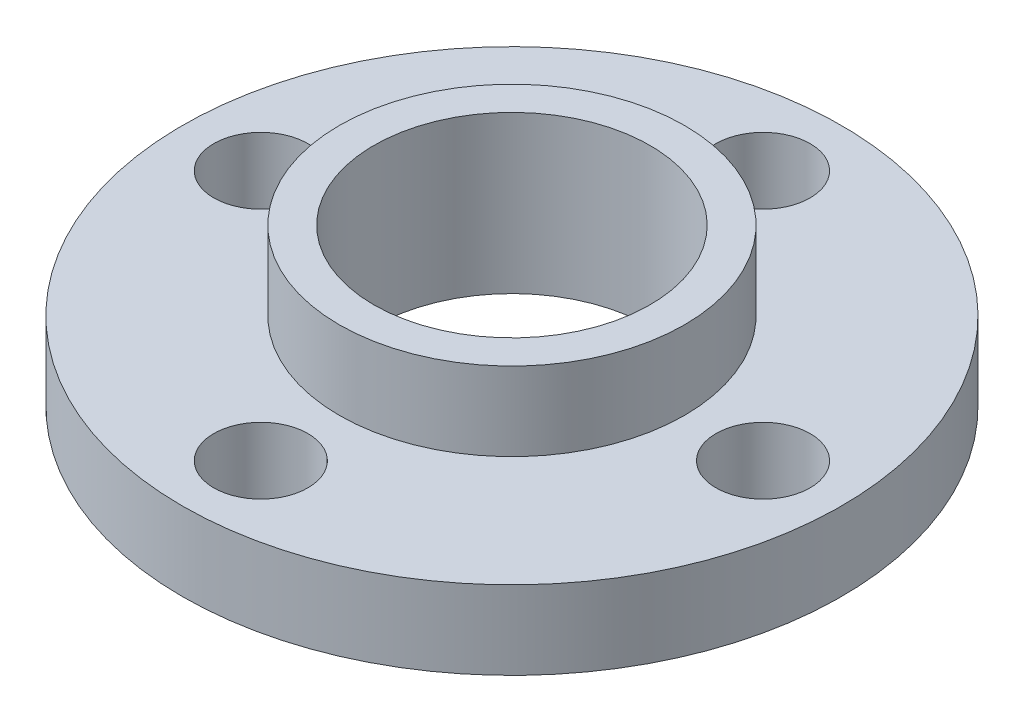
ISO-10303-21;
HEADER;
FILE_DESCRIPTION(('STEP AP214'),'2;1');
FILE_NAME('part.step','',(''),(''),'','','');
FILE_SCHEMA(('AUTOMOTIVE_DESIGN { 1 0 10303 214 1 1 1 1 }'));
ENDSEC;
DATA;
#1=APPLICATION_CONTEXT('core data for automotive mechanical design processes');
#2=APPLICATION_PROTOCOL_DEFINITION('international standard','automotive_design',2000,#1);
#3=PRODUCT_CONTEXT('',#1,'mechanical');
#4=PRODUCT('Part','Part','',(#3));
#5=PRODUCT_RELATED_PRODUCT_CATEGORY('part','',(#4));
#6=PRODUCT_DEFINITION_FORMATION('','',#4);
#7=PRODUCT_DEFINITION_CONTEXT('part definition',#1,'design');
#8=PRODUCT_DEFINITION('design','',#6,#7);
#9=PRODUCT_DEFINITION_SHAPE('','',#8);
#10=(LENGTH_UNIT() NAMED_UNIT(*) SI_UNIT(.MILLI.,.METRE.));
#11=(NAMED_UNIT(*) PLANE_ANGLE_UNIT() SI_UNIT($,.RADIAN.));
#12=(NAMED_UNIT(*) SI_UNIT($,.STERADIAN.) SOLID_ANGLE_UNIT());
#13=UNCERTAINTY_MEASURE_WITH_UNIT(LENGTH_MEASURE(1.E-05),#10,'distance_accuracy_value','');
#14=(GEOMETRIC_REPRESENTATION_CONTEXT(3) GLOBAL_UNCERTAINTY_ASSIGNED_CONTEXT((#13)) GLOBAL_UNIT_ASSIGNED_CONTEXT((#10,
#11,#12)) REPRESENTATION_CONTEXT('',''));
#15=CARTESIAN_POINT('',(0.,0.,0.));
#16=DIRECTION('',(0.,0.,1.));
#17=DIRECTION('',(1.,0.,0.));
#18=AXIS2_PLACEMENT_3D('',#15,#16,#17);
#19=CARTESIAN_POINT('',(0.,2.5,0.));
#20=DIRECTION('',(0.,1.,0.));
#21=DIRECTION('',(0.,0.,1.));
#22=AXIS2_PLACEMENT_3D('',#19,#20,#21);
#23=PLANE('',#22);
#24=CARTESIAN_POINT('',(0.,2.5,8.));
#25=DIRECTION('',(0.,1.,0.));
#26=DIRECTION('',(1.,0.,0.));
#27=AXIS2_PLACEMENT_3D('',#24,#25,#26);
#28=CIRCLE('',#27,1.5);
#29=CARTESIAN_POINT('',(1.50000000000003,2.5,7.99999999999999));
#30=VERTEX_POINT('',#29);
#31=EDGE_CURVE('E75',#30,#30,#28,.T.);
#32=ORIENTED_EDGE('',*,*,#31,.F.);
#33=EDGE_LOOP('',(#32));
#34=FACE_BOUND('',#33,.T.);
#35=CARTESIAN_POINT('',(8.,2.5,0.));
#36=DIRECTION('',(0.,1.,0.));
#37=DIRECTION('',(0.,0.,-1.));
#38=AXIS2_PLACEMENT_3D('',#35,#36,#37);
#39=CIRCLE('',#38,1.5);
#40=CARTESIAN_POINT('',(8.,2.5,-1.5));
#41=VERTEX_POINT('',#40);
#42=EDGE_CURVE('E69',#41,#41,#39,.T.);
#43=ORIENTED_EDGE('',*,*,#42,.F.);
#44=EDGE_LOOP('',(#43));
#45=FACE_BOUND('',#44,.T.);
#46=CARTESIAN_POINT('',(0.,2.5,-8.));
#47=DIRECTION('',(0.,1.,0.));
#48=DIRECTION('',(-1.,0.,0.));
#49=AXIS2_PLACEMENT_3D('',#46,#47,#48);
#50=CIRCLE('',#49,1.5);
#51=CARTESIAN_POINT('',(-1.50000000000008,2.5,-7.99999999999998));
#52=VERTEX_POINT('',#51);
#53=EDGE_CURVE('E63',#52,#52,#50,.T.);
#54=ORIENTED_EDGE('',*,*,#53,.F.);
#55=EDGE_LOOP('',(#54));
#56=FACE_BOUND('',#55,.T.);
#57=CARTESIAN_POINT('',(-8.,2.5,0.));
#58=DIRECTION('',(0.,1.,0.));
#59=DIRECTION('',(0.,0.,1.));
#60=AXIS2_PLACEMENT_3D('',#57,#58,#59);
#61=CIRCLE('',#60,1.5);
#62=CARTESIAN_POINT('',(-8.,2.5,1.5));
#63=VERTEX_POINT('',#62);
#64=EDGE_CURVE('E57',#63,#63,#61,.T.);
#65=ORIENTED_EDGE('',*,*,#64,.F.);
#66=EDGE_LOOP('',(#65));
#67=FACE_BOUND('',#66,.T.);
#68=CARTESIAN_POINT('',(0.,2.5,0.));
#69=DIRECTION('',(0.,1.,0.));
#70=DIRECTION('',(0.,0.,1.));
#71=AXIS2_PLACEMENT_3D('',#68,#69,#70);
#72=CIRCLE('',#71,10.5);
#73=CARTESIAN_POINT('',(0.,2.5,10.5));
#74=VERTEX_POINT('',#73);
#75=EDGE_CURVE('E10',#74,#74,#72,.T.);
#76=ORIENTED_EDGE('',*,*,#75,.T.);
#77=EDGE_LOOP('',(#76));
#78=FACE_BOUND('',#77,.T.);
#79=CARTESIAN_POINT('',(0.,2.5,0.));
#80=DIRECTION('',(0.,1.,0.));
#81=DIRECTION('',(0.,0.,1.));
#82=AXIS2_PLACEMENT_3D('',#79,#80,#81);
#83=CIRCLE('',#82,5.5);
#84=CARTESIAN_POINT('',(0.,2.5,5.5));
#85=VERTEX_POINT('',#84);
#86=EDGE_CURVE('E48',#85,#85,#83,.T.);
#87=ORIENTED_EDGE('',*,*,#86,.F.);
#88=EDGE_LOOP('',(#87));
#89=FACE_BOUND('',#88,.T.);
#90=ADVANCED_FACE('F32',(#34,#45,#56,#67,#78,#89),#23,.T.);
#91=CARTESIAN_POINT('',(0.,0.,0.));
#92=DIRECTION('',(0.,1.,0.));
#93=DIRECTION('',(0.,0.,1.));
#94=AXIS2_PLACEMENT_3D('',#91,#92,#93);
#95=PLANE('',#94);
#96=CARTESIAN_POINT('',(0.,0.,8.));
#97=DIRECTION('',(0.,1.,0.));
#98=DIRECTION('',(1.,0.,0.));
#99=AXIS2_PLACEMENT_3D('',#96,#97,#98);
#100=CIRCLE('',#99,1.5);
#101=CARTESIAN_POINT('',(1.50000000000003,0.,7.99999999999999));
#102=VERTEX_POINT('',#101);
#103=EDGE_CURVE('E60',#102,#102,#100,.T.);
#104=ORIENTED_EDGE('',*,*,#103,.T.);
#105=EDGE_LOOP('',(#104));
#106=FACE_BOUND('',#105,.T.);
#107=CARTESIAN_POINT('',(8.,0.,0.));
#108=DIRECTION('',(0.,1.,0.));
#109=DIRECTION('',(0.,0.,-1.));
#110=AXIS2_PLACEMENT_3D('',#107,#108,#109);
#111=CIRCLE('',#110,1.5);
#112=CARTESIAN_POINT('',(8.,0.,-1.5));
#113=VERTEX_POINT('',#112);
#114=EDGE_CURVE('E72',#113,#113,#111,.T.);
#115=ORIENTED_EDGE('',*,*,#114,.T.);
#116=EDGE_LOOP('',(#115));
#117=FACE_BOUND('',#116,.T.);
#118=CARTESIAN_POINT('',(0.,0.,-8.));
#119=DIRECTION('',(0.,1.,0.));
#120=DIRECTION('',(-1.,0.,0.));
#121=AXIS2_PLACEMENT_3D('',#118,#119,#120);
#122=CIRCLE('',#121,1.5);
#123=CARTESIAN_POINT('',(-1.50000000000008,0.,-7.99999999999998));
#124=VERTEX_POINT('',#123);
#125=EDGE_CURVE('E66',#124,#124,#122,.T.);
#126=ORIENTED_EDGE('',*,*,#125,.T.);
#127=EDGE_LOOP('',(#126));
#128=FACE_BOUND('',#127,.T.);
#129=CARTESIAN_POINT('',(-8.,0.,0.));
#130=DIRECTION('',(0.,1.,0.));
#131=DIRECTION('',(0.,0.,1.));
#132=AXIS2_PLACEMENT_3D('',#129,#130,#131);
#133=CIRCLE('',#132,1.5);
#134=CARTESIAN_POINT('',(-8.,0.,1.5));
#135=VERTEX_POINT('',#134);
#136=EDGE_CURVE('E56',#135,#135,#133,.T.);
#137=ORIENTED_EDGE('',*,*,#136,.T.);
#138=EDGE_LOOP('',(#137));
#139=FACE_BOUND('',#138,.T.);
#140=CARTESIAN_POINT('',(0.,0.,0.));
#141=DIRECTION('',(0.,1.,0.));
#142=DIRECTION('',(0.,0.,1.));
#143=AXIS2_PLACEMENT_3D('',#140,#141,#142);
#144=CIRCLE('',#143,10.5);
#145=CARTESIAN_POINT('',(0.,0.,10.5));
#146=VERTEX_POINT('',#145);
#147=EDGE_CURVE('E36',#146,#146,#144,.T.);
#148=ORIENTED_EDGE('',*,*,#147,.F.);
#149=EDGE_LOOP('',(#148));
#150=FACE_BOUND('',#149,.T.);
#151=CARTESIAN_POINT('',(0.,0.,0.));
#152=DIRECTION('',(0.,1.,0.));
#153=DIRECTION('',(0.,0.,1.));
#154=AXIS2_PLACEMENT_3D('',#151,#152,#153);
#155=CIRCLE('',#154,4.4);
#156=CARTESIAN_POINT('',(0.,0.,4.4));
#157=VERTEX_POINT('',#156);
#158=EDGE_CURVE('E43',#157,#157,#155,.T.);
#159=ORIENTED_EDGE('',*,*,#158,.T.);
#160=EDGE_LOOP('',(#159));
#161=FACE_BOUND('',#160,.T.);
#162=ADVANCED_FACE('F81',(#106,#117,#128,#139,#150,#161),#95,.F.);
#163=CARTESIAN_POINT('',(0.,2.5,0.));
#164=DIRECTION('',(0.,-1.,0.));
#165=DIRECTION('',(0.,0.,-1.));
#166=AXIS2_PLACEMENT_3D('',#163,#164,#165);
#167=CYLINDRICAL_SURFACE('',#166,10.5);
#168=ORIENTED_EDGE('',*,*,#75,.F.);
#169=EDGE_LOOP('',(#168));
#170=FACE_BOUND('',#169,.T.);
#171=ORIENTED_EDGE('',*,*,#147,.T.);
#172=EDGE_LOOP('',(#171));
#173=FACE_BOUND('',#172,.T.);
#174=ADVANCED_FACE('F34',(#170,#173),#167,.T.);
#175=CARTESIAN_POINT('',(0.,2.5,0.));
#176=DIRECTION('',(0.,-1.,0.));
#177=DIRECTION('',(0.,0.,-1.));
#178=AXIS2_PLACEMENT_3D('',#175,#176,#177);
#179=CYLINDRICAL_SURFACE('',#178,4.4);
#180=ORIENTED_EDGE('',*,*,#158,.F.);
#181=EDGE_LOOP('',(#180));
#182=FACE_BOUND('',#181,.T.);
#183=CARTESIAN_POINT('',(0.,5.,0.));
#184=DIRECTION('',(0.,1.,0.));
#185=DIRECTION('',(0.,0.,1.));
#186=AXIS2_PLACEMENT_3D('',#183,#184,#185);
#187=CIRCLE('',#186,4.4);
#188=CARTESIAN_POINT('',(0.,5.,4.4));
#189=VERTEX_POINT('',#188);
#190=EDGE_CURVE('E51',#189,#189,#187,.T.);
#191=ORIENTED_EDGE('',*,*,#190,.T.);
#192=EDGE_LOOP('',(#191));
#193=FACE_BOUND('',#192,.T.);
#194=ADVANCED_FACE('F115',(#182,#193),#179,.F.);
#195=CARTESIAN_POINT('',(0.,5.,0.));
#196=DIRECTION('',(0.,1.,0.));
#197=DIRECTION('',(0.,0.,1.));
#198=AXIS2_PLACEMENT_3D('',#195,#196,#197);
#199=PLANE('',#198);
#200=CARTESIAN_POINT('',(0.,5.,0.));
#201=DIRECTION('',(0.,1.,0.));
#202=DIRECTION('',(0.,0.,1.));
#203=AXIS2_PLACEMENT_3D('',#200,#201,#202);
#204=CIRCLE('',#203,5.5);
#205=CARTESIAN_POINT('',(0.,5.,5.5));
#206=VERTEX_POINT('',#205);
#207=EDGE_CURVE('E47',#206,#206,#204,.T.);
#208=ORIENTED_EDGE('',*,*,#207,.T.);
#209=EDGE_LOOP('',(#208));
#210=FACE_BOUND('',#209,.T.);
#211=ORIENTED_EDGE('',*,*,#190,.F.);
#212=EDGE_LOOP('',(#211));
#213=FACE_BOUND('',#212,.T.);
#214=ADVANCED_FACE('F105',(#210,#213),#199,.T.);
#215=CARTESIAN_POINT('',(0.,5.,0.));
#216=DIRECTION('',(0.,-1.,0.));
#217=DIRECTION('',(0.,0.,-1.));
#218=AXIS2_PLACEMENT_3D('',#215,#216,#217);
#219=CYLINDRICAL_SURFACE('',#218,5.5);
#220=ORIENTED_EDGE('',*,*,#207,.F.);
#221=EDGE_LOOP('',(#220));
#222=FACE_BOUND('',#221,.T.);
#223=ORIENTED_EDGE('',*,*,#86,.T.);
#224=EDGE_LOOP('',(#223));
#225=FACE_BOUND('',#224,.T.);
#226=ADVANCED_FACE('F102',(#222,#225),#219,.T.);
#227=CARTESIAN_POINT('',(-8.,0.,0.));
#228=DIRECTION('',(0.,1.,0.));
#229=DIRECTION('',(0.,0.,1.));
#230=AXIS2_PLACEMENT_3D('',#227,#228,#229);
#231=CYLINDRICAL_SURFACE('',#230,1.5);
#232=ORIENTED_EDGE('',*,*,#136,.F.);
#233=EDGE_LOOP('',(#232));
#234=FACE_BOUND('',#233,.T.);
#235=ORIENTED_EDGE('',*,*,#64,.T.);
#236=EDGE_LOOP('',(#235));
#237=FACE_BOUND('',#236,.T.);
#238=ADVANCED_FACE('F104',(#234,#237),#231,.F.);
#239=CARTESIAN_POINT('',(0.,0.,-8.));
#240=DIRECTION('',(0.,1.,0.));
#241=DIRECTION('',(0.,0.,1.));
#242=AXIS2_PLACEMENT_3D('',#239,#240,#241);
#243=CYLINDRICAL_SURFACE('',#242,1.5);
#244=ORIENTED_EDGE('',*,*,#125,.F.);
#245=EDGE_LOOP('',(#244));
#246=FACE_BOUND('',#245,.T.);
#247=ORIENTED_EDGE('',*,*,#53,.T.);
#248=EDGE_LOOP('',(#247));
#249=FACE_BOUND('',#248,.T.);
#250=ADVANCED_FACE('F112',(#246,#249),#243,.F.);
#251=CARTESIAN_POINT('',(8.,0.,0.));
#252=DIRECTION('',(0.,1.,0.));
#253=DIRECTION('',(0.,0.,1.));
#254=AXIS2_PLACEMENT_3D('',#251,#252,#253);
#255=CYLINDRICAL_SURFACE('',#254,1.5);
#256=ORIENTED_EDGE('',*,*,#114,.F.);
#257=EDGE_LOOP('',(#256));
#258=FACE_BOUND('',#257,.T.);
#259=ORIENTED_EDGE('',*,*,#42,.T.);
#260=EDGE_LOOP('',(#259));
#261=FACE_BOUND('',#260,.T.);
#262=ADVANCED_FACE('F87',(#258,#261),#255,.F.);
#263=CARTESIAN_POINT('',(0.,0.,8.));
#264=DIRECTION('',(0.,1.,0.));
#265=DIRECTION('',(0.,0.,1.));
#266=AXIS2_PLACEMENT_3D('',#263,#264,#265);
#267=CYLINDRICAL_SURFACE('',#266,1.5);
#268=ORIENTED_EDGE('',*,*,#103,.F.);
#269=EDGE_LOOP('',(#268));
#270=FACE_BOUND('',#269,.T.);
#271=ORIENTED_EDGE('',*,*,#31,.T.);
#272=EDGE_LOOP('',(#271));
#273=FACE_BOUND('',#272,.T.);
#274=ADVANCED_FACE('F84',(#270,#273),#267,.F.);
#275=CLOSED_SHELL('',(#90,#162,#174,#194,#214,#226,#238,#250,#262,#274));
#276=MANIFOLD_SOLID_BREP('B2',#275);
#277=ADVANCED_BREP_SHAPE_REPRESENTATION('',(#18,#276),#14);
#278=SHAPE_DEFINITION_REPRESENTATION(#9,#277);
ENDSEC;
END-ISO-10303-21;
